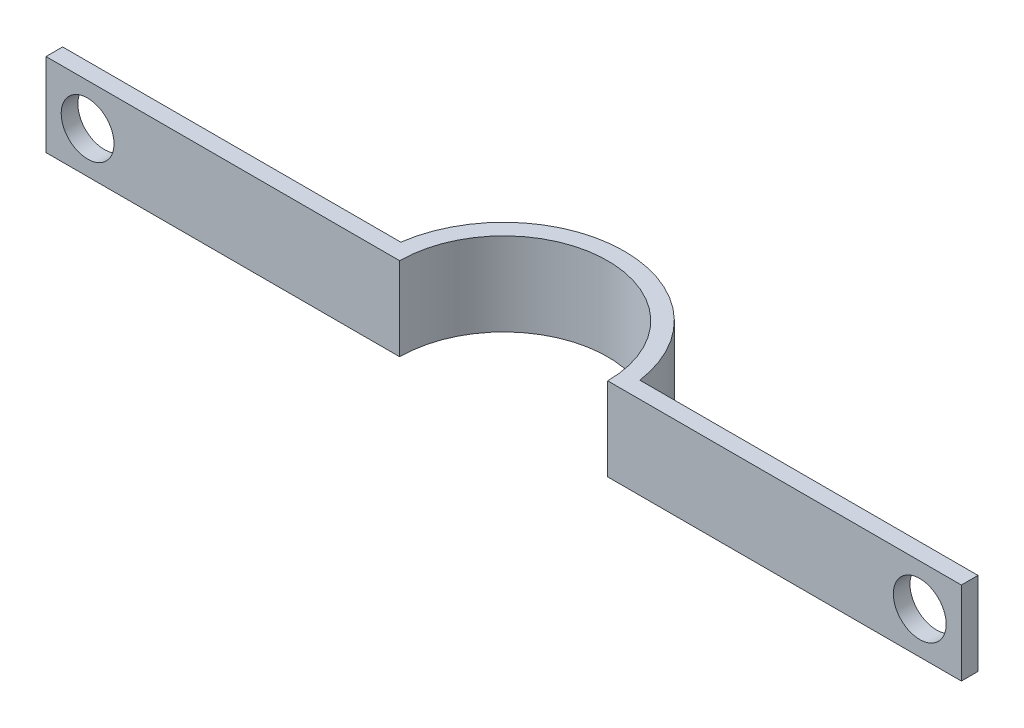
ISO-10303-21;
HEADER;
FILE_DESCRIPTION(('STEP AP214'),'2;1');
FILE_NAME('part.step','',(''),(''),'','','');
FILE_SCHEMA(('AUTOMOTIVE_DESIGN { 1 0 10303 214 1 1 1 1 }'));
ENDSEC;
DATA;
#1=APPLICATION_CONTEXT('core data for automotive mechanical design processes');
#2=APPLICATION_PROTOCOL_DEFINITION('international standard','automotive_design',2000,#1);
#3=PRODUCT_CONTEXT('',#1,'mechanical');
#4=PRODUCT('Part','Part','',(#3));
#5=PRODUCT_RELATED_PRODUCT_CATEGORY('part','',(#4));
#6=PRODUCT_DEFINITION_FORMATION('','',#4);
#7=PRODUCT_DEFINITION_CONTEXT('part definition',#1,'design');
#8=PRODUCT_DEFINITION('design','',#6,#7);
#9=PRODUCT_DEFINITION_SHAPE('','',#8);
#10=(LENGTH_UNIT() NAMED_UNIT(*) SI_UNIT(.MILLI.,.METRE.));
#11=(NAMED_UNIT(*) PLANE_ANGLE_UNIT() SI_UNIT($,.RADIAN.));
#12=(NAMED_UNIT(*) SI_UNIT($,.STERADIAN.) SOLID_ANGLE_UNIT());
#13=UNCERTAINTY_MEASURE_WITH_UNIT(LENGTH_MEASURE(1.E-05),#10,'distance_accuracy_value','');
#14=(GEOMETRIC_REPRESENTATION_CONTEXT(3) GLOBAL_UNCERTAINTY_ASSIGNED_CONTEXT((#13)) GLOBAL_UNIT_ASSIGNED_CONTEXT((#10,
#11,#12)) REPRESENTATION_CONTEXT('',''));
#15=CARTESIAN_POINT('',(0.,0.,0.));
#16=DIRECTION('',(0.,0.,1.));
#17=DIRECTION('',(1.,0.,0.));
#18=AXIS2_PLACEMENT_3D('',#15,#16,#17);
#19=CARTESIAN_POINT('',(220.,15.,11.2649567794205));
#20=DIRECTION('',(0.,0.,1.));
#21=DIRECTION('',(1.,0.,0.));
#22=AXIS2_PLACEMENT_3D('',#19,#20,#21);
#23=PLANE('',#22);
#24=DIRECTION('',(0.,-1.,0.));
#25=VECTOR('',#24,1.);
#26=CARTESIAN_POINT('',(-50.,-25.,11.2649567794205));
#27=LINE('',#26,#25);
#28=CARTESIAN_POINT('',(-50.,15.,11.2649567794205));
#29=VERTEX_POINT('',#28);
#30=CARTESIAN_POINT('',(-50.,-25.,11.2649567794205));
#31=VERTEX_POINT('',#30);
#32=EDGE_CURVE('E11',#29,#31,#27,.T.);
#33=ORIENTED_EDGE('',*,*,#32,.F.);
#34=DIRECTION('',(-1.,0.,0.));
#35=VECTOR('',#34,1.);
#36=CARTESIAN_POINT('',(220.,15.,11.2649567794205));
#37=LINE('',#36,#35);
#38=CARTESIAN_POINT('',(-220.,15.,11.2649567794205));
#39=VERTEX_POINT('',#38);
#40=EDGE_CURVE('E176',#29,#39,#37,.T.);
#41=ORIENTED_EDGE('',*,*,#40,.T.);
#42=DIRECTION('',(0.,-1.,0.));
#43=VECTOR('',#42,1.);
#44=CARTESIAN_POINT('',(-220.,15.,11.2649567794205));
#45=LINE('',#44,#43);
#46=CARTESIAN_POINT('',(-220.,-25.,11.2649567794205));
#47=VERTEX_POINT('',#46);
#48=EDGE_CURVE('E156',#39,#47,#45,.T.);
#49=ORIENTED_EDGE('',*,*,#48,.T.);
#50=DIRECTION('',(-1.,0.,0.));
#51=VECTOR('',#50,1.);
#52=CARTESIAN_POINT('',(220.,-25.,11.2649567794205));
#53=LINE('',#52,#51);
#54=EDGE_CURVE('E137',#31,#47,#53,.T.);
#55=ORIENTED_EDGE('',*,*,#54,.F.);
#56=EDGE_LOOP('',(#33,#41,#49,#55));
#57=FACE_BOUND('',#56,.T.);
#58=CARTESIAN_POINT('',(-200.,-5.00000000000001,11.2649567794206));
#59=DIRECTION('',(0.,0.,-1.));
#60=DIRECTION('',(-1.,0.,0.));
#61=AXIS2_PLACEMENT_3D('',#58,#59,#60);
#62=CIRCLE('',#61,12.7);
#63=CARTESIAN_POINT('',(-212.7,-5.00000000000001,11.2649567794206));
#64=VERTEX_POINT('',#63);
#65=EDGE_CURVE('E138',#64,#64,#62,.T.);
#66=ORIENTED_EDGE('',*,*,#65,.T.);
#67=EDGE_LOOP('',(#66));
#68=FACE_BOUND('',#67,.T.);
#69=ADVANCED_FACE('F34',(#57,#68),#23,.T.);
#70=CARTESIAN_POINT('',(220.,15.,3.26495677942058));
#71=DIRECTION('',(1.,0.,0.));
#72=DIRECTION('',(0.,0.,-1.));
#73=AXIS2_PLACEMENT_3D('',#70,#71,#72);
#74=PLANE('',#73);
#75=DIRECTION('',(0.,0.,1.));
#76=VECTOR('',#75,1.);
#77=CARTESIAN_POINT('',(220.,-25.,3.26495677942058));
#78=LINE('',#77,#76);
#79=CARTESIAN_POINT('',(220.,-25.,3.26495677942058));
#80=VERTEX_POINT('',#79);
#81=CARTESIAN_POINT('',(220.,-25.,11.2649567794205));
#82=VERTEX_POINT('',#81);
#83=EDGE_CURVE('E134',#80,#82,#78,.T.);
#84=ORIENTED_EDGE('',*,*,#83,.F.);
#85=DIRECTION('',(0.,-1.,0.));
#86=VECTOR('',#85,1.);
#87=CARTESIAN_POINT('',(220.,15.,3.26495677942058));
#88=LINE('',#87,#86);
#89=CARTESIAN_POINT('',(220.,15.,3.26495677942058));
#90=VERTEX_POINT('',#89);
#91=EDGE_CURVE('E57',#90,#80,#88,.T.);
#92=ORIENTED_EDGE('',*,*,#91,.F.);
#93=DIRECTION('',(0.,0.,1.));
#94=VECTOR('',#93,1.);
#95=CARTESIAN_POINT('',(220.,15.,3.26495677942058));
#96=LINE('',#95,#94);
#97=CARTESIAN_POINT('',(220.,15.,11.2649567794205));
#98=VERTEX_POINT('',#97);
#99=EDGE_CURVE('E151',#90,#98,#96,.T.);
#100=ORIENTED_EDGE('',*,*,#99,.T.);
#101=DIRECTION('',(0.,-1.,0.));
#102=VECTOR('',#101,1.);
#103=CARTESIAN_POINT('',(220.,15.,11.2649567794205));
#104=LINE('',#103,#102);
#105=EDGE_CURVE('E90',#98,#82,#104,.T.);
#106=ORIENTED_EDGE('',*,*,#105,.T.);
#107=EDGE_LOOP('',(#84,#92,#100,#106));
#108=FACE_BOUND('',#107,.T.);
#109=ADVANCED_FACE('F36',(#108),#74,.T.);
#110=CARTESIAN_POINT('',(57.4456264653803,15.,3.26495677942055));
#111=DIRECTION('',(0.,0.,-1.));
#112=DIRECTION('',(-1.,0.,0.));
#113=AXIS2_PLACEMENT_3D('',#110,#111,#112);
#114=PLANE('',#113);
#115=CARTESIAN_POINT('',(200.,-5.,3.26495677942057));
#116=DIRECTION('',(0.,0.,-1.));
#117=DIRECTION('',(-1.,0.,0.));
#118=AXIS2_PLACEMENT_3D('',#115,#116,#117);
#119=CIRCLE('',#118,12.7);
#120=CARTESIAN_POINT('',(187.3,-5.,3.26495677942057));
#121=VERTEX_POINT('',#120);
#122=EDGE_CURVE('E165',#121,#121,#119,.T.);
#123=ORIENTED_EDGE('',*,*,#122,.F.);
#124=EDGE_LOOP('',(#123));
#125=FACE_BOUND('',#124,.T.);
#126=DIRECTION('',(1.,0.,0.));
#127=VECTOR('',#126,1.);
#128=CARTESIAN_POINT('',(57.4456264653803,-25.,3.26495677942055));
#129=LINE('',#128,#127);
#130=CARTESIAN_POINT('',(57.4456264653803,-25.,3.26495677942053));
#131=VERTEX_POINT('',#130);
#132=EDGE_CURVE('E148',#131,#80,#129,.T.);
#133=ORIENTED_EDGE('',*,*,#132,.F.);
#134=DIRECTION('',(0.,-1.,0.));
#135=VECTOR('',#134,1.);
#136=CARTESIAN_POINT('',(57.4456264653803,15.,3.26495677942053));
#137=LINE('',#136,#135);
#138=CARTESIAN_POINT('',(57.4456264653803,15.,3.26495677942053));
#139=VERTEX_POINT('',#138);
#140=EDGE_CURVE('E114',#139,#131,#137,.T.);
#141=ORIENTED_EDGE('',*,*,#140,.F.);
#142=DIRECTION('',(1.,0.,0.));
#143=VECTOR('',#142,1.);
#144=CARTESIAN_POINT('',(57.4456264653803,15.,3.26495677942055));
#145=LINE('',#144,#143);
#146=EDGE_CURVE('E124',#139,#90,#145,.T.);
#147=ORIENTED_EDGE('',*,*,#146,.T.);
#148=ORIENTED_EDGE('',*,*,#91,.T.);
#149=EDGE_LOOP('',(#133,#141,#147,#148));
#150=FACE_BOUND('',#149,.T.);
#151=ADVANCED_FACE('F192',(#125,#150),#114,.T.);
#152=CARTESIAN_POINT('',(0.,15.,11.2649567794205));
#153=DIRECTION('',(0.,-1.,0.));
#154=DIRECTION('',(0.,0.,-1.));
#155=AXIS2_PLACEMENT_3D('',#152,#153,#154);
#156=CYLINDRICAL_SURFACE('',#155,58.);
#157=CARTESIAN_POINT('',(0.,-25.,11.2649567794205));
#158=DIRECTION('',(0.,-1.,0.));
#159=DIRECTION('',(0.,0.,-1.));
#160=AXIS2_PLACEMENT_3D('',#157,#158,#159);
#161=CIRCLE('',#160,58.);
#162=CARTESIAN_POINT('',(-57.4456264653803,-25.,3.26495677942058));
#163=VERTEX_POINT('',#162);
#164=EDGE_CURVE('E109',#163,#131,#161,.T.);
#165=ORIENTED_EDGE('',*,*,#164,.F.);
#166=DIRECTION('',(0.,-1.,0.));
#167=VECTOR('',#166,1.);
#168=CARTESIAN_POINT('',(-57.4456264653803,15.,3.26495677942058));
#169=LINE('',#168,#167);
#170=CARTESIAN_POINT('',(-57.4456264653803,15.,3.26495677942058));
#171=VERTEX_POINT('',#170);
#172=EDGE_CURVE('E103',#171,#163,#169,.T.);
#173=ORIENTED_EDGE('',*,*,#172,.F.);
#174=CARTESIAN_POINT('',(0.,15.,11.2649567794205));
#175=DIRECTION('',(0.,-1.,0.));
#176=DIRECTION('',(0.,0.,-1.));
#177=AXIS2_PLACEMENT_3D('',#174,#175,#176);
#178=CIRCLE('',#177,58.);
#179=EDGE_CURVE('E106',#171,#139,#178,.T.);
#180=ORIENTED_EDGE('',*,*,#179,.T.);
#181=ORIENTED_EDGE('',*,*,#140,.T.);
#182=EDGE_LOOP('',(#165,#173,#180,#181));
#183=FACE_BOUND('',#182,.T.);
#184=ADVANCED_FACE('F105',(#183),#156,.T.);
#185=CARTESIAN_POINT('',(-220.,15.,3.26495677942055));
#186=DIRECTION('',(0.,0.,-1.));
#187=DIRECTION('',(-1.,0.,0.));
#188=AXIS2_PLACEMENT_3D('',#185,#186,#187);
#189=PLANE('',#188);
#190=CARTESIAN_POINT('',(-200.,-5.00000000000001,3.26495677942049));
#191=DIRECTION('',(0.,0.,-1.));
#192=DIRECTION('',(-1.,0.,0.));
#193=AXIS2_PLACEMENT_3D('',#190,#191,#192);
#194=CIRCLE('',#193,12.7);
#195=CARTESIAN_POINT('',(-212.7,-5.00000000000001,3.26495677942049));
#196=VERTEX_POINT('',#195);
#197=EDGE_CURVE('E171',#196,#196,#194,.T.);
#198=ORIENTED_EDGE('',*,*,#197,.F.);
#199=EDGE_LOOP('',(#198));
#200=FACE_BOUND('',#199,.T.);
#201=DIRECTION('',(1.,0.,0.));
#202=VECTOR('',#201,1.);
#203=CARTESIAN_POINT('',(-220.,-25.,3.26495677942055));
#204=LINE('',#203,#202);
#205=CARTESIAN_POINT('',(-220.,-25.,3.26495677942055));
#206=VERTEX_POINT('',#205);
#207=EDGE_CURVE('E145',#206,#163,#204,.T.);
#208=ORIENTED_EDGE('',*,*,#207,.F.);
#209=DIRECTION('',(0.,-1.,0.));
#210=VECTOR('',#209,1.);
#211=CARTESIAN_POINT('',(-220.,15.,3.26495677942055));
#212=LINE('',#211,#210);
#213=CARTESIAN_POINT('',(-220.,15.,3.26495677942055));
#214=VERTEX_POINT('',#213);
#215=EDGE_CURVE('E115',#214,#206,#212,.T.);
#216=ORIENTED_EDGE('',*,*,#215,.F.);
#217=DIRECTION('',(1.,0.,0.));
#218=VECTOR('',#217,1.);
#219=CARTESIAN_POINT('',(-220.,15.,3.26495677942055));
#220=LINE('',#219,#218);
#221=EDGE_CURVE('E122',#214,#171,#220,.T.);
#222=ORIENTED_EDGE('',*,*,#221,.T.);
#223=ORIENTED_EDGE('',*,*,#172,.T.);
#224=EDGE_LOOP('',(#208,#216,#222,#223));
#225=FACE_BOUND('',#224,.T.);
#226=ADVANCED_FACE('F126',(#200,#225),#189,.T.);
#227=CARTESIAN_POINT('',(-220.,15.,11.2649567794205));
#228=DIRECTION('',(-1.,0.,0.));
#229=DIRECTION('',(0.,0.,1.));
#230=AXIS2_PLACEMENT_3D('',#227,#228,#229);
#231=PLANE('',#230);
#232=DIRECTION('',(0.,0.,-1.));
#233=VECTOR('',#232,1.);
#234=CARTESIAN_POINT('',(-220.,-25.,11.2649567794205));
#235=LINE('',#234,#233);
#236=EDGE_CURVE('E142',#47,#206,#235,.T.);
#237=ORIENTED_EDGE('',*,*,#236,.F.);
#238=ORIENTED_EDGE('',*,*,#48,.F.);
#239=DIRECTION('',(0.,0.,-1.));
#240=VECTOR('',#239,1.);
#241=CARTESIAN_POINT('',(-220.,15.,11.2649567794205));
#242=LINE('',#241,#240);
#243=EDGE_CURVE('E127',#39,#214,#242,.T.);
#244=ORIENTED_EDGE('',*,*,#243,.T.);
#245=ORIENTED_EDGE('',*,*,#215,.T.);
#246=EDGE_LOOP('',(#237,#238,#244,#245));
#247=FACE_BOUND('',#246,.T.);
#248=ADVANCED_FACE('F185',(#247),#231,.T.);
#249=DIRECTION('',(0.,-1.,0.));
#250=VECTOR('',#249,1.);
#251=CARTESIAN_POINT('',(50.,-25.,11.2649567794205));
#252=LINE('',#251,#250);
#253=CARTESIAN_POINT('',(50.,-25.,11.2649567794205));
#254=VERTEX_POINT('',#253);
#255=CARTESIAN_POINT('',(50.,15.,11.2649567794205));
#256=VERTEX_POINT('',#255);
#257=EDGE_CURVE('E42',#254,#256,#252,.F.);
#258=ORIENTED_EDGE('',*,*,#257,.F.);
#259=EDGE_CURVE('E139',#82,#254,#53,.T.);
#260=ORIENTED_EDGE('',*,*,#259,.F.);
#261=ORIENTED_EDGE('',*,*,#105,.F.);
#262=EDGE_CURVE('E129',#98,#256,#37,.T.);
#263=ORIENTED_EDGE('',*,*,#262,.T.);
#264=EDGE_LOOP('',(#258,#260,#261,#263));
#265=FACE_BOUND('',#264,.T.);
#266=CARTESIAN_POINT('',(200.,-5.,11.2649567794206));
#267=DIRECTION('',(0.,0.,-1.));
#268=DIRECTION('',(-1.,0.,0.));
#269=AXIS2_PLACEMENT_3D('',#266,#267,#268);
#270=CIRCLE('',#269,12.7);
#271=CARTESIAN_POINT('',(187.3,-5.,11.2649567794206));
#272=VERTEX_POINT('',#271);
#273=EDGE_CURVE('E168',#272,#272,#270,.T.);
#274=ORIENTED_EDGE('',*,*,#273,.T.);
#275=EDGE_LOOP('',(#274));
#276=FACE_BOUND('',#275,.T.);
#277=ADVANCED_FACE('F190',(#265,#276),#23,.T.);
#278=CARTESIAN_POINT('',(0.,15.,11.2649567794205));
#279=DIRECTION('',(0.,-1.,0.));
#280=DIRECTION('',(0.,0.,-1.));
#281=AXIS2_PLACEMENT_3D('',#278,#279,#280);
#282=PLANE('',#281);
#283=ORIENTED_EDGE('',*,*,#40,.F.);
#284=CARTESIAN_POINT('',(0.,15.,11.2649567794205));
#285=DIRECTION('',(0.,-1.,0.));
#286=DIRECTION('',(0.,0.,-1.));
#287=AXIS2_PLACEMENT_3D('',#284,#285,#286);
#288=CIRCLE('',#287,50.);
#289=EDGE_CURVE('E153',#29,#256,#288,.T.);
#290=ORIENTED_EDGE('',*,*,#289,.T.);
#291=ORIENTED_EDGE('',*,*,#262,.F.);
#292=ORIENTED_EDGE('',*,*,#99,.F.);
#293=ORIENTED_EDGE('',*,*,#146,.F.);
#294=ORIENTED_EDGE('',*,*,#179,.F.);
#295=ORIENTED_EDGE('',*,*,#221,.F.);
#296=ORIENTED_EDGE('',*,*,#243,.F.);
#297=EDGE_LOOP('',(#283,#290,#291,#292,#293,#294,#295,#296));
#298=FACE_BOUND('',#297,.T.);
#299=ADVANCED_FACE('F120',(#298),#282,.F.);
#300=CARTESIAN_POINT('',(0.,-25.,11.2649567794205));
#301=DIRECTION('',(0.,-1.,0.));
#302=DIRECTION('',(0.,0.,-1.));
#303=AXIS2_PLACEMENT_3D('',#300,#301,#302);
#304=PLANE('',#303);
#305=CARTESIAN_POINT('',(0.,-25.,11.2649567794205));
#306=DIRECTION('',(0.,-1.,0.));
#307=DIRECTION('',(0.,0.,-1.));
#308=AXIS2_PLACEMENT_3D('',#305,#306,#307);
#309=CIRCLE('',#308,50.);
#310=EDGE_CURVE('E159',#31,#254,#309,.T.);
#311=ORIENTED_EDGE('',*,*,#310,.F.);
#312=ORIENTED_EDGE('',*,*,#54,.T.);
#313=ORIENTED_EDGE('',*,*,#236,.T.);
#314=ORIENTED_EDGE('',*,*,#207,.T.);
#315=ORIENTED_EDGE('',*,*,#164,.T.);
#316=ORIENTED_EDGE('',*,*,#132,.T.);
#317=ORIENTED_EDGE('',*,*,#83,.T.);
#318=ORIENTED_EDGE('',*,*,#259,.T.);
#319=EDGE_LOOP('',(#311,#312,#313,#314,#315,#316,#317,#318));
#320=FACE_BOUND('',#319,.T.);
#321=ADVANCED_FACE('F187',(#320),#304,.T.);
#322=CARTESIAN_POINT('',(-200.,-5.00000000000001,3.26495677942049));
#323=DIRECTION('',(0.,0.,-1.));
#324=DIRECTION('',(-1.,0.,0.));
#325=AXIS2_PLACEMENT_3D('',#322,#323,#324);
#326=CYLINDRICAL_SURFACE('',#325,12.7);
#327=ORIENTED_EDGE('',*,*,#65,.F.);
#328=EDGE_LOOP('',(#327));
#329=FACE_BOUND('',#328,.T.);
#330=ORIENTED_EDGE('',*,*,#197,.T.);
#331=EDGE_LOOP('',(#330));
#332=FACE_BOUND('',#331,.T.);
#333=ADVANCED_FACE('F222',(#329,#332),#326,.F.);
#334=CARTESIAN_POINT('',(200.,-5.,3.26495677942058));
#335=DIRECTION('',(0.,0.,-1.));
#336=DIRECTION('',(-1.,0.,0.));
#337=AXIS2_PLACEMENT_3D('',#334,#335,#336);
#338=CYLINDRICAL_SURFACE('',#337,12.7);
#339=ORIENTED_EDGE('',*,*,#273,.F.);
#340=EDGE_LOOP('',(#339));
#341=FACE_BOUND('',#340,.T.);
#342=ORIENTED_EDGE('',*,*,#122,.T.);
#343=EDGE_LOOP('',(#342));
#344=FACE_BOUND('',#343,.T.);
#345=ADVANCED_FACE('F224',(#341,#344),#338,.F.);
#346=CARTESIAN_POINT('',(0.,-25.,11.2649567794205));
#347=DIRECTION('',(0.,-1.,0.));
#348=DIRECTION('',(0.,0.,-1.));
#349=AXIS2_PLACEMENT_3D('',#346,#347,#348);
#350=CYLINDRICAL_SURFACE('',#349,50.);
#351=ORIENTED_EDGE('',*,*,#32,.T.);
#352=ORIENTED_EDGE('',*,*,#310,.T.);
#353=ORIENTED_EDGE('',*,*,#257,.T.);
#354=ORIENTED_EDGE('',*,*,#289,.F.);
#355=EDGE_LOOP('',(#351,#352,#353,#354));
#356=FACE_BOUND('',#355,.T.);
#357=ADVANCED_FACE('F189',(#356),#350,.F.);
#358=CLOSED_SHELL('',(#69,#109,#151,#184,#226,#248,#277,#299,#321,#333,#345,#357));
#359=MANIFOLD_SOLID_BREP('B2',#358);
#360=ADVANCED_BREP_SHAPE_REPRESENTATION('',(#18,#359),#14);
#361=SHAPE_DEFINITION_REPRESENTATION(#9,#360);
ENDSEC;
END-ISO-10303-21;
